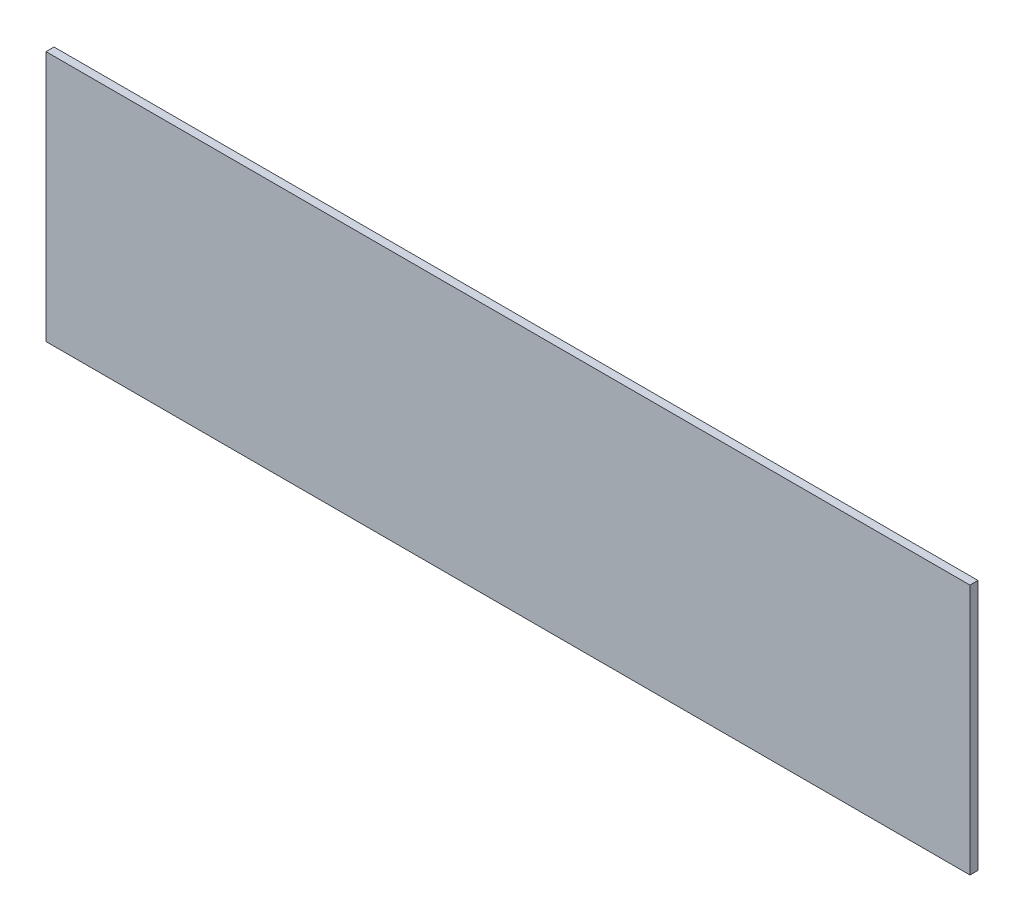
ISO-10303-21;
HEADER;
FILE_DESCRIPTION(('STEP AP214'),'2;1');
FILE_NAME('part.step','',(''),(''),'','','');
FILE_SCHEMA(('AUTOMOTIVE_DESIGN { 1 0 10303 214 1 1 1 1 }'));
ENDSEC;
DATA;
#1=APPLICATION_CONTEXT('core data for automotive mechanical design processes');
#2=APPLICATION_PROTOCOL_DEFINITION('international standard','automotive_design',2000,#1);
#3=PRODUCT_CONTEXT('',#1,'mechanical');
#4=PRODUCT('Part','Part','',(#3));
#5=PRODUCT_RELATED_PRODUCT_CATEGORY('part','',(#4));
#6=PRODUCT_DEFINITION_FORMATION('','',#4);
#7=PRODUCT_DEFINITION_CONTEXT('part definition',#1,'design');
#8=PRODUCT_DEFINITION('design','',#6,#7);
#9=PRODUCT_DEFINITION_SHAPE('','',#8);
#10=(LENGTH_UNIT() NAMED_UNIT(*) SI_UNIT(.MILLI.,.METRE.));
#11=(NAMED_UNIT(*) PLANE_ANGLE_UNIT() SI_UNIT($,.RADIAN.));
#12=(NAMED_UNIT(*) SI_UNIT($,.STERADIAN.) SOLID_ANGLE_UNIT());
#13=UNCERTAINTY_MEASURE_WITH_UNIT(LENGTH_MEASURE(1.E-05),#10,'distance_accuracy_value','');
#14=(GEOMETRIC_REPRESENTATION_CONTEXT(3) GLOBAL_UNCERTAINTY_ASSIGNED_CONTEXT((#13)) GLOBAL_UNIT_ASSIGNED_CONTEXT((#10,
#11,#12)) REPRESENTATION_CONTEXT('',''));
#15=CARTESIAN_POINT('',(0.,0.,0.));
#16=DIRECTION('',(0.,0.,1.));
#17=DIRECTION('',(1.,0.,0.));
#18=AXIS2_PLACEMENT_3D('',#15,#16,#17);
#19=CARTESIAN_POINT('',(2.29972616,-0.62500002,0.03999992));
#20=DIRECTION('',(0.,0.,1.));
#21=DIRECTION('',(1.,0.,0.));
#22=AXIS2_PLACEMENT_3D('',#19,#20,#21);
#23=PLANE('',#22);
#24=DIRECTION('',(0.,-1.,0.));
#25=VECTOR('',#24,1.);
#26=CARTESIAN_POINT('',(2.29972616,0.62500002,0.03999992));
#27=LINE('',#26,#25);
#28=CARTESIAN_POINT('',(2.29972616,0.62500002,0.03999992));
#29=VERTEX_POINT('',#28);
#30=CARTESIAN_POINT('',(2.29972616,-0.62500002,0.03999992));
#31=VERTEX_POINT('',#30);
#32=EDGE_CURVE('E27',#29,#31,#27,.T.);
#33=ORIENTED_EDGE('',*,*,#32,.F.);
#34=DIRECTION('',(1.,0.,0.));
#35=VECTOR('',#34,1.);
#36=CARTESIAN_POINT('',(-2.29972362,0.62500002,0.03999992));
#37=LINE('',#36,#35);
#38=CARTESIAN_POINT('',(-2.29972362,0.62500002,0.03999992));
#39=VERTEX_POINT('',#38);
#40=EDGE_CURVE('E98',#39,#29,#37,.T.);
#41=ORIENTED_EDGE('',*,*,#40,.F.);
#42=DIRECTION('',(0.,1.,0.));
#43=VECTOR('',#42,1.);
#44=CARTESIAN_POINT('',(-2.29972362,-0.62500002,0.03999992));
#45=LINE('',#44,#43);
#46=CARTESIAN_POINT('',(-2.29972362,-0.62500002,0.03999992));
#47=VERTEX_POINT('',#46);
#48=EDGE_CURVE('E62',#47,#39,#45,.T.);
#49=ORIENTED_EDGE('',*,*,#48,.F.);
#50=DIRECTION('',(-1.,0.,0.));
#51=VECTOR('',#50,1.);
#52=CARTESIAN_POINT('',(2.29972616,-0.62500002,0.03999992));
#53=LINE('',#52,#51);
#54=EDGE_CURVE('E77',#31,#47,#53,.T.);
#55=ORIENTED_EDGE('',*,*,#54,.F.);
#56=EDGE_LOOP('',(#33,#41,#49,#55));
#57=FACE_BOUND('',#56,.T.);
#58=ADVANCED_FACE('F17',(#57),#23,.T.);
#59=CARTESIAN_POINT('',(2.29972616,-0.62500002,0.));
#60=DIRECTION('',(0.,0.,1.));
#61=DIRECTION('',(1.,0.,0.));
#62=AXIS2_PLACEMENT_3D('',#59,#60,#61);
#63=PLANE('',#62);
#64=DIRECTION('',(-1.,0.,0.));
#65=VECTOR('',#64,1.);
#66=CARTESIAN_POINT('',(2.29972616,-0.62500002,0.));
#67=LINE('',#66,#65);
#68=CARTESIAN_POINT('',(2.29972616,-0.62500002,0.));
#69=VERTEX_POINT('',#68);
#70=CARTESIAN_POINT('',(-2.29972362,-0.62500002,0.));
#71=VERTEX_POINT('',#70);
#72=EDGE_CURVE('E86',#69,#71,#67,.T.);
#73=ORIENTED_EDGE('',*,*,#72,.T.);
#74=DIRECTION('',(0.,1.,0.));
#75=VECTOR('',#74,1.);
#76=CARTESIAN_POINT('',(-2.29972362,-0.62500002,0.));
#77=LINE('',#76,#75);
#78=CARTESIAN_POINT('',(-2.29972362,0.62500002,0.));
#79=VERTEX_POINT('',#78);
#80=EDGE_CURVE('E96',#71,#79,#77,.T.);
#81=ORIENTED_EDGE('',*,*,#80,.T.);
#82=DIRECTION('',(1.,0.,0.));
#83=VECTOR('',#82,1.);
#84=CARTESIAN_POINT('',(-2.29972362,0.62500002,0.));
#85=LINE('',#84,#83);
#86=CARTESIAN_POINT('',(2.29972616,0.62500002,0.));
#87=VERTEX_POINT('',#86);
#88=EDGE_CURVE('E75',#79,#87,#85,.T.);
#89=ORIENTED_EDGE('',*,*,#88,.T.);
#90=DIRECTION('',(0.,-1.,0.));
#91=VECTOR('',#90,1.);
#92=CARTESIAN_POINT('',(2.29972616,0.62500002,0.));
#93=LINE('',#92,#91);
#94=EDGE_CURVE('E11',#87,#69,#93,.T.);
#95=ORIENTED_EDGE('',*,*,#94,.T.);
#96=EDGE_LOOP('',(#73,#81,#89,#95));
#97=FACE_BOUND('',#96,.T.);
#98=ADVANCED_FACE('F187',(#97),#63,.F.);
#99=CARTESIAN_POINT('',(2.29972616,0.62500002,0.));
#100=DIRECTION('',(1.,0.,0.));
#101=DIRECTION('',(0.,1.,0.));
#102=AXIS2_PLACEMENT_3D('',#99,#100,#101);
#103=PLANE('',#102);
#104=DIRECTION('',(0.,0.,1.));
#105=VECTOR('',#104,1.);
#106=CARTESIAN_POINT('',(2.29972616,0.62500002,0.));
#107=LINE('',#106,#105);
#108=EDGE_CURVE('E72',#87,#29,#107,.T.);
#109=ORIENTED_EDGE('',*,*,#108,.T.);
#110=ORIENTED_EDGE('',*,*,#32,.T.);
#111=DIRECTION('',(0.,0.,1.));
#112=VECTOR('',#111,1.);
#113=CARTESIAN_POINT('',(2.29972616,-0.62500002,0.));
#114=LINE('',#113,#112);
#115=EDGE_CURVE('E70',#69,#31,#114,.T.);
#116=ORIENTED_EDGE('',*,*,#115,.F.);
#117=ORIENTED_EDGE('',*,*,#94,.F.);
#118=EDGE_LOOP('',(#109,#110,#116,#117));
#119=FACE_BOUND('',#118,.T.);
#120=ADVANCED_FACE('F68',(#119),#103,.T.);
#121=CARTESIAN_POINT('',(-2.29972362,0.62500002,0.));
#122=DIRECTION('',(0.,1.,0.));
#123=DIRECTION('',(1.,0.,0.));
#124=AXIS2_PLACEMENT_3D('',#121,#122,#123);
#125=PLANE('',#124);
#126=DIRECTION('',(0.,0.,1.));
#127=VECTOR('',#126,1.);
#128=CARTESIAN_POINT('',(-2.29972362,0.62500002,0.));
#129=LINE('',#128,#127);
#130=EDGE_CURVE('E93',#79,#39,#129,.T.);
#131=ORIENTED_EDGE('',*,*,#130,.T.);
#132=ORIENTED_EDGE('',*,*,#40,.T.);
#133=ORIENTED_EDGE('',*,*,#108,.F.);
#134=ORIENTED_EDGE('',*,*,#88,.F.);
#135=EDGE_LOOP('',(#131,#132,#133,#134));
#136=FACE_BOUND('',#135,.T.);
#137=ADVANCED_FACE('F19',(#136),#125,.T.);
#138=CARTESIAN_POINT('',(-2.29972362,-0.62500002,0.));
#139=DIRECTION('',(-1.,0.,0.));
#140=DIRECTION('',(0.,0.,1.));
#141=AXIS2_PLACEMENT_3D('',#138,#139,#140);
#142=PLANE('',#141);
#143=DIRECTION('',(0.,0.,1.));
#144=VECTOR('',#143,1.);
#145=CARTESIAN_POINT('',(-2.29972362,-0.62500002,0.));
#146=LINE('',#145,#144);
#147=EDGE_CURVE('E81',#71,#47,#146,.T.);
#148=ORIENTED_EDGE('',*,*,#147,.T.);
#149=ORIENTED_EDGE('',*,*,#48,.T.);
#150=ORIENTED_EDGE('',*,*,#130,.F.);
#151=ORIENTED_EDGE('',*,*,#80,.F.);
#152=EDGE_LOOP('',(#148,#149,#150,#151));
#153=FACE_BOUND('',#152,.T.);
#154=ADVANCED_FACE('F157',(#153),#142,.T.);
#155=CARTESIAN_POINT('',(2.29972616,-0.62500002,0.));
#156=DIRECTION('',(0.,-1.,0.));
#157=DIRECTION('',(0.,0.,-1.));
#158=AXIS2_PLACEMENT_3D('',#155,#156,#157);
#159=PLANE('',#158);
#160=ORIENTED_EDGE('',*,*,#115,.T.);
#161=ORIENTED_EDGE('',*,*,#54,.T.);
#162=ORIENTED_EDGE('',*,*,#147,.F.);
#163=ORIENTED_EDGE('',*,*,#72,.F.);
#164=EDGE_LOOP('',(#160,#161,#162,#163));
#165=FACE_BOUND('',#164,.T.);
#166=ADVANCED_FACE('F84',(#165),#159,.T.);
#167=CLOSED_SHELL('',(#58,#98,#120,#137,#154,#166));
#168=MANIFOLD_SOLID_BREP('B1',#167);
#169=ADVANCED_BREP_SHAPE_REPRESENTATION('',(#18,#168),#14);
#170=SHAPE_DEFINITION_REPRESENTATION(#9,#169);
ENDSEC;
END-ISO-10303-21;
